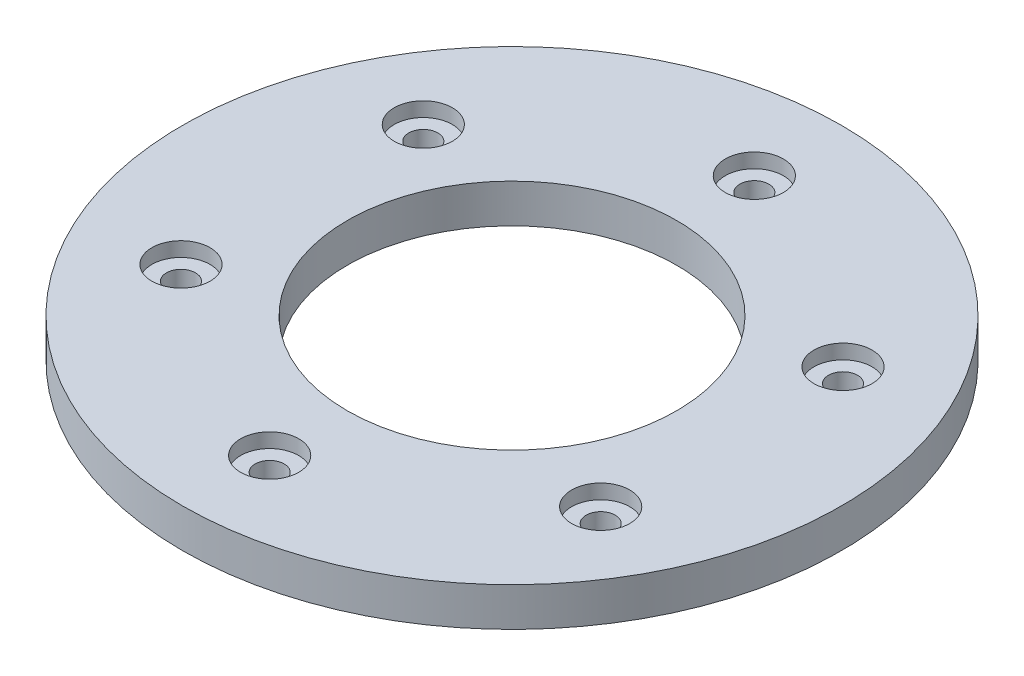
ISO-10303-21;
HEADER;
FILE_DESCRIPTION(('STEP AP214'),'2;1');
FILE_NAME('part.step','',(''),(''),'','','');
FILE_SCHEMA(('AUTOMOTIVE_DESIGN { 1 0 10303 214 1 1 1 1 }'));
ENDSEC;
DATA;
#1=APPLICATION_CONTEXT('core data for automotive mechanical design processes');
#2=APPLICATION_PROTOCOL_DEFINITION('international standard','automotive_design',2000,#1);
#3=PRODUCT_CONTEXT('',#1,'mechanical');
#4=PRODUCT('Part','Part','',(#3));
#5=PRODUCT_RELATED_PRODUCT_CATEGORY('part','',(#4));
#6=PRODUCT_DEFINITION_FORMATION('','',#4);
#7=PRODUCT_DEFINITION_CONTEXT('part definition',#1,'design');
#8=PRODUCT_DEFINITION('design','',#6,#7);
#9=PRODUCT_DEFINITION_SHAPE('','',#8);
#10=(LENGTH_UNIT() NAMED_UNIT(*) SI_UNIT(.MILLI.,.METRE.));
#11=(NAMED_UNIT(*) PLANE_ANGLE_UNIT() SI_UNIT($,.RADIAN.));
#12=(NAMED_UNIT(*) SI_UNIT($,.STERADIAN.) SOLID_ANGLE_UNIT());
#13=UNCERTAINTY_MEASURE_WITH_UNIT(LENGTH_MEASURE(1.E-05),#10,'distance_accuracy_value','');
#14=(GEOMETRIC_REPRESENTATION_CONTEXT(3) GLOBAL_UNCERTAINTY_ASSIGNED_CONTEXT((#13)) GLOBAL_UNIT_ASSIGNED_CONTEXT((#10,
#11,#12)) REPRESENTATION_CONTEXT('',''));
#15=CARTESIAN_POINT('',(0.,0.,0.));
#16=DIRECTION('',(0.,0.,1.));
#17=DIRECTION('',(1.,0.,0.));
#18=AXIS2_PLACEMENT_3D('',#15,#16,#17);
#19=CARTESIAN_POINT('',(0.,4.,0.));
#20=DIRECTION('',(0.,-1.,0.));
#21=DIRECTION('',(0.,0.,-1.));
#22=AXIS2_PLACEMENT_3D('',#19,#20,#21);
#23=CYLINDRICAL_SURFACE('',#22,34.);
#24=CARTESIAN_POINT('',(0.,4.,0.));
#25=DIRECTION('',(0.,1.,0.));
#26=DIRECTION('',(0.,0.,1.));
#27=AXIS2_PLACEMENT_3D('',#24,#25,#26);
#28=CIRCLE('',#27,34.);
#29=CARTESIAN_POINT('',(0.,4.,34.));
#30=VERTEX_POINT('',#29);
#31=EDGE_CURVE('E10',#30,#30,#28,.T.);
#32=ORIENTED_EDGE('',*,*,#31,.F.);
#33=EDGE_LOOP('',(#32));
#34=FACE_BOUND('',#33,.T.);
#35=CARTESIAN_POINT('',(0.,0.,0.));
#36=DIRECTION('',(0.,1.,0.));
#37=DIRECTION('',(0.,0.,1.));
#38=AXIS2_PLACEMENT_3D('',#35,#36,#37);
#39=CIRCLE('',#38,34.);
#40=CARTESIAN_POINT('',(0.,0.,34.));
#41=VERTEX_POINT('',#40);
#42=EDGE_CURVE('E41',#41,#41,#39,.T.);
#43=ORIENTED_EDGE('',*,*,#42,.T.);
#44=EDGE_LOOP('',(#43));
#45=FACE_BOUND('',#44,.T.);
#46=ADVANCED_FACE('F34',(#34,#45),#23,.T.);
#47=CARTESIAN_POINT('',(0.,4.,0.));
#48=DIRECTION('',(0.,1.,0.));
#49=DIRECTION('',(0.,0.,1.));
#50=AXIS2_PLACEMENT_3D('',#47,#48,#49);
#51=PLANE('',#50);
#52=CARTESIAN_POINT('',(0.,4.,0.));
#53=DIRECTION('',(0.,1.,0.));
#54=DIRECTION('',(0.,0.,1.));
#55=AXIS2_PLACEMENT_3D('',#52,#53,#54);
#56=CIRCLE('',#55,17.);
#57=CARTESIAN_POINT('',(0.,4.,17.));
#58=VERTEX_POINT('',#57);
#59=EDGE_CURVE('E238',#58,#58,#56,.T.);
#60=ORIENTED_EDGE('',*,*,#59,.F.);
#61=EDGE_LOOP('',(#60));
#62=FACE_BOUND('',#61,.T.);
#63=CARTESIAN_POINT('',(0.,4.,-25.));
#64=DIRECTION('',(0.,1.,0.));
#65=DIRECTION('',(0.,0.,1.));
#66=AXIS2_PLACEMENT_3D('',#63,#64,#65);
#67=CIRCLE('',#66,3.00000000000001);
#68=CARTESIAN_POINT('',(0.,4.,-22.));
#69=VERTEX_POINT('',#68);
#70=EDGE_CURVE('E88',#69,#69,#67,.T.);
#71=ORIENTED_EDGE('',*,*,#70,.F.);
#72=EDGE_LOOP('',(#71));
#73=FACE_BOUND('',#72,.T.);
#74=CARTESIAN_POINT('',(21.6506350946117,4.,-12.5000000000012));
#75=DIRECTION('',(0.,1.,0.));
#76=DIRECTION('',(0.,0.,1.));
#77=AXIS2_PLACEMENT_3D('',#74,#75,#76);
#78=CIRCLE('',#77,3.00000000000001);
#79=CARTESIAN_POINT('',(21.6506350946117,4.,-9.50000000000122));
#80=VERTEX_POINT('',#79);
#81=EDGE_CURVE('E75',#80,#80,#78,.T.);
#82=ORIENTED_EDGE('',*,*,#81,.F.);
#83=EDGE_LOOP('',(#82));
#84=FACE_BOUND('',#83,.T.);
#85=CARTESIAN_POINT('',(21.6506350946131,4.,12.4999999999988));
#86=DIRECTION('',(0.,1.,0.));
#87=DIRECTION('',(0.,0.,1.));
#88=AXIS2_PLACEMENT_3D('',#85,#86,#87);
#89=CIRCLE('',#88,3.00000000000001);
#90=CARTESIAN_POINT('',(21.6506350946131,4.,15.4999999999988));
#91=VERTEX_POINT('',#90);
#92=EDGE_CURVE('E71',#91,#91,#89,.T.);
#93=ORIENTED_EDGE('',*,*,#92,.F.);
#94=EDGE_LOOP('',(#93));
#95=FACE_BOUND('',#94,.T.);
#96=CARTESIAN_POINT('',(2.83604770904466E-12,4.,25.));
#97=DIRECTION('',(0.,1.,0.));
#98=DIRECTION('',(0.,0.,1.));
#99=AXIS2_PLACEMENT_3D('',#96,#97,#98);
#100=CIRCLE('',#99,3.00000000000001);
#101=CARTESIAN_POINT('',(2.83604770904466E-12,4.,28.));
#102=VERTEX_POINT('',#101);
#103=EDGE_CURVE('E67',#102,#102,#100,.T.);
#104=ORIENTED_EDGE('',*,*,#103,.F.);
#105=EDGE_LOOP('',(#104));
#106=FACE_BOUND('',#105,.T.);
#107=CARTESIAN_POINT('',(-21.6506350946088,4.,12.5000000000012));
#108=DIRECTION('',(0.,1.,0.));
#109=DIRECTION('',(0.,0.,1.));
#110=AXIS2_PLACEMENT_3D('',#107,#108,#109);
#111=CIRCLE('',#110,3.00000000000001);
#112=CARTESIAN_POINT('',(-21.6506350946088,4.,15.5000000000013));
#113=VERTEX_POINT('',#112);
#114=EDGE_CURVE('E62',#113,#113,#111,.T.);
#115=ORIENTED_EDGE('',*,*,#114,.F.);
#116=EDGE_LOOP('',(#115));
#117=FACE_BOUND('',#116,.T.);
#118=CARTESIAN_POINT('',(-21.6506350946103,4.,-12.4999999999988));
#119=DIRECTION('',(0.,1.,0.));
#120=DIRECTION('',(0.,0.,1.));
#121=AXIS2_PLACEMENT_3D('',#118,#119,#120);
#122=CIRCLE('',#121,3.00000000000001);
#123=CARTESIAN_POINT('',(-21.6506350946103,4.,-9.49999999999874));
#124=VERTEX_POINT('',#123);
#125=EDGE_CURVE('E57',#124,#124,#122,.T.);
#126=ORIENTED_EDGE('',*,*,#125,.F.);
#127=EDGE_LOOP('',(#126));
#128=FACE_BOUND('',#127,.T.);
#129=ORIENTED_EDGE('',*,*,#31,.T.);
#130=EDGE_LOOP('',(#129));
#131=FACE_BOUND('',#130,.T.);
#132=ADVANCED_FACE('F142',(#62,#73,#84,#95,#106,#117,#128,#131),#51,.T.);
#133=CARTESIAN_POINT('',(0.,0.,0.));
#134=DIRECTION('',(0.,1.,0.));
#135=DIRECTION('',(0.,0.,1.));
#136=AXIS2_PLACEMENT_3D('',#133,#134,#135);
#137=PLANE('',#136);
#138=CARTESIAN_POINT('',(0.,0.,0.));
#139=DIRECTION('',(0.,1.,0.));
#140=DIRECTION('',(0.,0.,1.));
#141=AXIS2_PLACEMENT_3D('',#138,#139,#140);
#142=CIRCLE('',#141,17.);
#143=CARTESIAN_POINT('',(0.,0.,17.));
#144=VERTEX_POINT('',#143);
#145=EDGE_CURVE('E37',#144,#144,#142,.T.);
#146=ORIENTED_EDGE('',*,*,#145,.T.);
#147=EDGE_LOOP('',(#146));
#148=FACE_BOUND('',#147,.T.);
#149=CARTESIAN_POINT('',(0.,0.,-25.));
#150=DIRECTION('',(0.,1.,0.));
#151=DIRECTION('',(0.,0.,1.));
#152=AXIS2_PLACEMENT_3D('',#149,#150,#151);
#153=CIRCLE('',#152,1.50000000000001);
#154=CARTESIAN_POINT('',(0.,0.,-23.5));
#155=VERTEX_POINT('',#154);
#156=EDGE_CURVE('E73',#155,#155,#153,.T.);
#157=ORIENTED_EDGE('',*,*,#156,.T.);
#158=EDGE_LOOP('',(#157));
#159=FACE_BOUND('',#158,.T.);
#160=CARTESIAN_POINT('',(21.6506350946117,0.,-12.5000000000012));
#161=DIRECTION('',(0.,1.,0.));
#162=DIRECTION('',(0.,0.,1.));
#163=AXIS2_PLACEMENT_3D('',#160,#161,#162);
#164=CIRCLE('',#163,1.50000000000001);
#165=CARTESIAN_POINT('',(21.6506350946117,0.,-11.0000000000012));
#166=VERTEX_POINT('',#165);
#167=EDGE_CURVE('E69',#166,#166,#164,.T.);
#168=ORIENTED_EDGE('',*,*,#167,.T.);
#169=EDGE_LOOP('',(#168));
#170=FACE_BOUND('',#169,.T.);
#171=CARTESIAN_POINT('',(21.6506350946131,0.,12.4999999999988));
#172=DIRECTION('',(0.,1.,0.));
#173=DIRECTION('',(0.,0.,1.));
#174=AXIS2_PLACEMENT_3D('',#171,#172,#173);
#175=CIRCLE('',#174,1.50000000000001);
#176=CARTESIAN_POINT('',(21.6506350946131,0.,13.9999999999988));
#177=VERTEX_POINT('',#176);
#178=EDGE_CURVE('E64',#177,#177,#175,.T.);
#179=ORIENTED_EDGE('',*,*,#178,.T.);
#180=EDGE_LOOP('',(#179));
#181=FACE_BOUND('',#180,.T.);
#182=CARTESIAN_POINT('',(2.83604770904466E-12,0.,25.));
#183=DIRECTION('',(0.,1.,0.));
#184=DIRECTION('',(0.,0.,1.));
#185=AXIS2_PLACEMENT_3D('',#182,#183,#184);
#186=CIRCLE('',#185,1.50000000000001);
#187=CARTESIAN_POINT('',(2.83604770904466E-12,0.,26.5));
#188=VERTEX_POINT('',#187);
#189=EDGE_CURVE('E59',#188,#188,#186,.T.);
#190=ORIENTED_EDGE('',*,*,#189,.T.);
#191=EDGE_LOOP('',(#190));
#192=FACE_BOUND('',#191,.T.);
#193=CARTESIAN_POINT('',(-21.6506350946088,0.,12.5000000000012));
#194=DIRECTION('',(0.,1.,0.));
#195=DIRECTION('',(0.,0.,1.));
#196=AXIS2_PLACEMENT_3D('',#193,#194,#195);
#197=CIRCLE('',#196,1.50000000000001);
#198=CARTESIAN_POINT('',(-21.6506350946088,0.,14.0000000000012));
#199=VERTEX_POINT('',#198);
#200=EDGE_CURVE('E54',#199,#199,#197,.T.);
#201=ORIENTED_EDGE('',*,*,#200,.T.);
#202=EDGE_LOOP('',(#201));
#203=FACE_BOUND('',#202,.T.);
#204=CARTESIAN_POINT('',(-21.6506350946103,0.,-12.4999999999988));
#205=DIRECTION('',(0.,1.,0.));
#206=DIRECTION('',(0.,0.,1.));
#207=AXIS2_PLACEMENT_3D('',#204,#205,#206);
#208=CIRCLE('',#207,1.50000000000001);
#209=CARTESIAN_POINT('',(-21.6506350946103,0.,-10.9999999999987));
#210=VERTEX_POINT('',#209);
#211=EDGE_CURVE('E46',#210,#210,#208,.T.);
#212=ORIENTED_EDGE('',*,*,#211,.T.);
#213=EDGE_LOOP('',(#212));
#214=FACE_BOUND('',#213,.T.);
#215=ORIENTED_EDGE('',*,*,#42,.F.);
#216=EDGE_LOOP('',(#215));
#217=FACE_BOUND('',#216,.T.);
#218=ADVANCED_FACE('F139',(#148,#159,#170,#181,#192,#203,#214,#217),#137,.F.);
#219=CARTESIAN_POINT('',(-21.6506350946103,4.,-12.4999999999988));
#220=DIRECTION('',(0.,1.,0.));
#221=DIRECTION('',(0.,0.,1.));
#222=AXIS2_PLACEMENT_3D('',#219,#220,#221);
#223=CYLINDRICAL_SURFACE('',#222,1.50000000000001);
#224=CARTESIAN_POINT('',(-21.6506350946103,2.5,-12.4999999999988));
#225=DIRECTION('',(0.,1.,0.));
#226=DIRECTION('',(0.,0.,1.));
#227=AXIS2_PLACEMENT_3D('',#224,#225,#226);
#228=CIRCLE('',#227,1.50000000000001);
#229=CARTESIAN_POINT('',(-21.6506350946103,2.5,-10.9999999999987));
#230=VERTEX_POINT('',#229);
#231=EDGE_CURVE('E49',#230,#230,#228,.T.);
#232=ORIENTED_EDGE('',*,*,#231,.T.);
#233=EDGE_LOOP('',(#232));
#234=FACE_BOUND('',#233,.T.);
#235=ORIENTED_EDGE('',*,*,#211,.F.);
#236=EDGE_LOOP('',(#235));
#237=FACE_BOUND('',#236,.T.);
#238=ADVANCED_FACE('F125',(#234,#237),#223,.F.);
#239=CARTESIAN_POINT('',(-20.1506350946103,2.5,-12.4999999999988));
#240=DIRECTION('',(0.,-1.,0.));
#241=DIRECTION('',(0.,0.,-1.));
#242=AXIS2_PLACEMENT_3D('',#239,#240,#241);
#243=PLANE('',#242);
#244=ORIENTED_EDGE('',*,*,#231,.F.);
#245=EDGE_LOOP('',(#244));
#246=FACE_BOUND('',#245,.T.);
#247=CARTESIAN_POINT('',(-21.6506350946103,2.5,-12.4999999999988));
#248=DIRECTION('',(0.,1.,0.));
#249=DIRECTION('',(0.,0.,1.));
#250=AXIS2_PLACEMENT_3D('',#247,#248,#249);
#251=CIRCLE('',#250,3.00000000000001);
#252=CARTESIAN_POINT('',(-21.6506350946103,2.5,-9.49999999999874));
#253=VERTEX_POINT('',#252);
#254=EDGE_CURVE('E118',#253,#253,#251,.T.);
#255=ORIENTED_EDGE('',*,*,#254,.T.);
#256=EDGE_LOOP('',(#255));
#257=FACE_BOUND('',#256,.T.);
#258=ADVANCED_FACE('F128',(#246,#257),#243,.F.);
#259=CARTESIAN_POINT('',(-21.6506350946103,4.,-12.4999999999988));
#260=DIRECTION('',(0.,1.,0.));
#261=DIRECTION('',(0.,0.,1.));
#262=AXIS2_PLACEMENT_3D('',#259,#260,#261);
#263=CYLINDRICAL_SURFACE('',#262,3.00000000000001);
#264=ORIENTED_EDGE('',*,*,#254,.F.);
#265=EDGE_LOOP('',(#264));
#266=FACE_BOUND('',#265,.T.);
#267=ORIENTED_EDGE('',*,*,#125,.T.);
#268=EDGE_LOOP('',(#267));
#269=FACE_BOUND('',#268,.T.);
#270=ADVANCED_FACE('F130',(#266,#269),#263,.F.);
#271=CARTESIAN_POINT('',(-21.6506350946088,4.,12.5000000000012));
#272=DIRECTION('',(0.,1.,0.));
#273=DIRECTION('',(0.,0.,1.));
#274=AXIS2_PLACEMENT_3D('',#271,#272,#273);
#275=CYLINDRICAL_SURFACE('',#274,1.50000000000001);
#276=CARTESIAN_POINT('',(-21.6506350946088,2.5,12.5000000000012));
#277=DIRECTION('',(0.,1.,0.));
#278=DIRECTION('',(0.,0.,1.));
#279=AXIS2_PLACEMENT_3D('',#276,#277,#278);
#280=CIRCLE('',#279,1.50000000000001);
#281=CARTESIAN_POINT('',(-21.6506350946088,2.5,14.0000000000012));
#282=VERTEX_POINT('',#281);
#283=EDGE_CURVE('E58',#282,#282,#280,.T.);
#284=ORIENTED_EDGE('',*,*,#283,.T.);
#285=EDGE_LOOP('',(#284));
#286=FACE_BOUND('',#285,.T.);
#287=ORIENTED_EDGE('',*,*,#200,.F.);
#288=EDGE_LOOP('',(#287));
#289=FACE_BOUND('',#288,.T.);
#290=ADVANCED_FACE('F136',(#286,#289),#275,.F.);
#291=CARTESIAN_POINT('',(-20.1506350946088,2.5,12.5000000000012));
#292=DIRECTION('',(0.,-1.,0.));
#293=DIRECTION('',(0.,0.,-1.));
#294=AXIS2_PLACEMENT_3D('',#291,#292,#293);
#295=PLANE('',#294);
#296=ORIENTED_EDGE('',*,*,#283,.F.);
#297=EDGE_LOOP('',(#296));
#298=FACE_BOUND('',#297,.T.);
#299=CARTESIAN_POINT('',(-21.6506350946088,2.5,12.5000000000012));
#300=DIRECTION('',(0.,1.,0.));
#301=DIRECTION('',(0.,0.,1.));
#302=AXIS2_PLACEMENT_3D('',#299,#300,#301);
#303=CIRCLE('',#302,3.00000000000001);
#304=CARTESIAN_POINT('',(-21.6506350946088,2.5,15.5000000000013));
#305=VERTEX_POINT('',#304);
#306=EDGE_CURVE('E112',#305,#305,#303,.T.);
#307=ORIENTED_EDGE('',*,*,#306,.T.);
#308=EDGE_LOOP('',(#307));
#309=FACE_BOUND('',#308,.T.);
#310=ADVANCED_FACE('F170',(#298,#309),#295,.F.);
#311=CARTESIAN_POINT('',(-21.6506350946088,4.,12.5000000000012));
#312=DIRECTION('',(0.,1.,0.));
#313=DIRECTION('',(0.,0.,1.));
#314=AXIS2_PLACEMENT_3D('',#311,#312,#313);
#315=CYLINDRICAL_SURFACE('',#314,3.00000000000001);
#316=ORIENTED_EDGE('',*,*,#306,.F.);
#317=EDGE_LOOP('',(#316));
#318=FACE_BOUND('',#317,.T.);
#319=ORIENTED_EDGE('',*,*,#114,.T.);
#320=EDGE_LOOP('',(#319));
#321=FACE_BOUND('',#320,.T.);
#322=ADVANCED_FACE('F176',(#318,#321),#315,.F.);
#323=CARTESIAN_POINT('',(2.83604770904466E-12,4.,25.));
#324=DIRECTION('',(0.,1.,0.));
#325=DIRECTION('',(0.,0.,1.));
#326=AXIS2_PLACEMENT_3D('',#323,#324,#325);
#327=CYLINDRICAL_SURFACE('',#326,1.50000000000001);
#328=CARTESIAN_POINT('',(2.83604770904466E-12,2.5,25.));
#329=DIRECTION('',(0.,1.,0.));
#330=DIRECTION('',(0.,0.,1.));
#331=AXIS2_PLACEMENT_3D('',#328,#329,#330);
#332=CIRCLE('',#331,1.50000000000001);
#333=CARTESIAN_POINT('',(2.83604770904466E-12,2.5,26.5));
#334=VERTEX_POINT('',#333);
#335=EDGE_CURVE('E63',#334,#334,#332,.T.);
#336=ORIENTED_EDGE('',*,*,#335,.T.);
#337=EDGE_LOOP('',(#336));
#338=FACE_BOUND('',#337,.T.);
#339=ORIENTED_EDGE('',*,*,#189,.F.);
#340=EDGE_LOOP('',(#339));
#341=FACE_BOUND('',#340,.T.);
#342=ADVANCED_FACE('F182',(#338,#341),#327,.F.);
#343=CARTESIAN_POINT('',(1.50000000000285,2.5,25.));
#344=DIRECTION('',(0.,-1.,0.));
#345=DIRECTION('',(0.,0.,-1.));
#346=AXIS2_PLACEMENT_3D('',#343,#344,#345);
#347=PLANE('',#346);
#348=ORIENTED_EDGE('',*,*,#335,.F.);
#349=EDGE_LOOP('',(#348));
#350=FACE_BOUND('',#349,.T.);
#351=CARTESIAN_POINT('',(2.83604770904466E-12,2.5,25.));
#352=DIRECTION('',(0.,1.,0.));
#353=DIRECTION('',(0.,0.,1.));
#354=AXIS2_PLACEMENT_3D('',#351,#352,#353);
#355=CIRCLE('',#354,3.00000000000001);
#356=CARTESIAN_POINT('',(2.83604770904466E-12,2.5,28.));
#357=VERTEX_POINT('',#356);
#358=EDGE_CURVE('E105',#357,#357,#355,.T.);
#359=ORIENTED_EDGE('',*,*,#358,.T.);
#360=EDGE_LOOP('',(#359));
#361=FACE_BOUND('',#360,.T.);
#362=ADVANCED_FACE('F186',(#350,#361),#347,.F.);
#363=CARTESIAN_POINT('',(2.83604770904466E-12,4.,25.));
#364=DIRECTION('',(0.,1.,0.));
#365=DIRECTION('',(0.,0.,1.));
#366=AXIS2_PLACEMENT_3D('',#363,#364,#365);
#367=CYLINDRICAL_SURFACE('',#366,3.00000000000001);
#368=ORIENTED_EDGE('',*,*,#358,.F.);
#369=EDGE_LOOP('',(#368));
#370=FACE_BOUND('',#369,.T.);
#371=ORIENTED_EDGE('',*,*,#103,.T.);
#372=EDGE_LOOP('',(#371));
#373=FACE_BOUND('',#372,.T.);
#374=ADVANCED_FACE('F190',(#370,#373),#367,.F.);
#375=CARTESIAN_POINT('',(21.6506350946131,4.,12.4999999999988));
#376=DIRECTION('',(0.,1.,0.));
#377=DIRECTION('',(0.,0.,1.));
#378=AXIS2_PLACEMENT_3D('',#375,#376,#377);
#379=CYLINDRICAL_SURFACE('',#378,1.50000000000001);
#380=CARTESIAN_POINT('',(21.6506350946131,2.5,12.4999999999988));
#381=DIRECTION('',(0.,1.,0.));
#382=DIRECTION('',(0.,0.,1.));
#383=AXIS2_PLACEMENT_3D('',#380,#381,#382);
#384=CIRCLE('',#383,1.50000000000002);
#385=CARTESIAN_POINT('',(21.6506350946131,2.5,13.9999999999988));
#386=VERTEX_POINT('',#385);
#387=EDGE_CURVE('E68',#386,#386,#384,.T.);
#388=ORIENTED_EDGE('',*,*,#387,.T.);
#389=EDGE_LOOP('',(#388));
#390=FACE_BOUND('',#389,.T.);
#391=ORIENTED_EDGE('',*,*,#178,.F.);
#392=EDGE_LOOP('',(#391));
#393=FACE_BOUND('',#392,.T.);
#394=ADVANCED_FACE('F194',(#390,#393),#379,.F.);
#395=CARTESIAN_POINT('',(23.1506350946131,2.5,12.4999999999988));
#396=DIRECTION('',(0.,-1.,0.));
#397=DIRECTION('',(0.,0.,-1.));
#398=AXIS2_PLACEMENT_3D('',#395,#396,#397);
#399=PLANE('',#398);
#400=ORIENTED_EDGE('',*,*,#387,.F.);
#401=EDGE_LOOP('',(#400));
#402=FACE_BOUND('',#401,.T.);
#403=CARTESIAN_POINT('',(21.6506350946131,2.5,12.4999999999988));
#404=DIRECTION('',(0.,1.,0.));
#405=DIRECTION('',(0.,0.,1.));
#406=AXIS2_PLACEMENT_3D('',#403,#404,#405);
#407=CIRCLE('',#406,3.00000000000001);
#408=CARTESIAN_POINT('',(21.6506350946131,2.5,15.4999999999988));
#409=VERTEX_POINT('',#408);
#410=EDGE_CURVE('E98',#409,#409,#407,.T.);
#411=ORIENTED_EDGE('',*,*,#410,.T.);
#412=EDGE_LOOP('',(#411));
#413=FACE_BOUND('',#412,.T.);
#414=ADVANCED_FACE('F198',(#402,#413),#399,.F.);
#415=CARTESIAN_POINT('',(21.6506350946131,4.,12.4999999999988));
#416=DIRECTION('',(0.,1.,0.));
#417=DIRECTION('',(0.,0.,1.));
#418=AXIS2_PLACEMENT_3D('',#415,#416,#417);
#419=CYLINDRICAL_SURFACE('',#418,3.00000000000001);
#420=ORIENTED_EDGE('',*,*,#410,.F.);
#421=EDGE_LOOP('',(#420));
#422=FACE_BOUND('',#421,.T.);
#423=ORIENTED_EDGE('',*,*,#92,.T.);
#424=EDGE_LOOP('',(#423));
#425=FACE_BOUND('',#424,.T.);
#426=ADVANCED_FACE('F202',(#422,#425),#419,.F.);
#427=CARTESIAN_POINT('',(21.6506350946117,4.,-12.5000000000012));
#428=DIRECTION('',(0.,1.,0.));
#429=DIRECTION('',(0.,0.,1.));
#430=AXIS2_PLACEMENT_3D('',#427,#428,#429);
#431=CYLINDRICAL_SURFACE('',#430,1.50000000000001);
#432=CARTESIAN_POINT('',(21.6506350946117,2.5,-12.5000000000012));
#433=DIRECTION('',(0.,1.,0.));
#434=DIRECTION('',(0.,0.,1.));
#435=AXIS2_PLACEMENT_3D('',#432,#433,#434);
#436=CIRCLE('',#435,1.50000000000002);
#437=CARTESIAN_POINT('',(21.6506350946117,2.5,-11.0000000000012));
#438=VERTEX_POINT('',#437);
#439=EDGE_CURVE('E72',#438,#438,#436,.T.);
#440=ORIENTED_EDGE('',*,*,#439,.T.);
#441=EDGE_LOOP('',(#440));
#442=FACE_BOUND('',#441,.T.);
#443=ORIENTED_EDGE('',*,*,#167,.F.);
#444=EDGE_LOOP('',(#443));
#445=FACE_BOUND('',#444,.T.);
#446=ADVANCED_FACE('F206',(#442,#445),#431,.F.);
#447=CARTESIAN_POINT('',(23.1506350946117,2.5,-12.5000000000012));
#448=DIRECTION('',(0.,-1.,0.));
#449=DIRECTION('',(0.,0.,-1.));
#450=AXIS2_PLACEMENT_3D('',#447,#448,#449);
#451=PLANE('',#450);
#452=ORIENTED_EDGE('',*,*,#439,.F.);
#453=EDGE_LOOP('',(#452));
#454=FACE_BOUND('',#453,.T.);
#455=CARTESIAN_POINT('',(21.6506350946117,2.5,-12.5000000000012));
#456=DIRECTION('',(0.,1.,0.));
#457=DIRECTION('',(0.,0.,1.));
#458=AXIS2_PLACEMENT_3D('',#455,#456,#457);
#459=CIRCLE('',#458,3.00000000000001);
#460=CARTESIAN_POINT('',(21.6506350946117,2.5,-9.50000000000122));
#461=VERTEX_POINT('',#460);
#462=EDGE_CURVE('E80',#461,#461,#459,.T.);
#463=ORIENTED_EDGE('',*,*,#462,.T.);
#464=EDGE_LOOP('',(#463));
#465=FACE_BOUND('',#464,.T.);
#466=ADVANCED_FACE('F210',(#454,#465),#451,.F.);
#467=CARTESIAN_POINT('',(21.6506350946117,4.,-12.5000000000012));
#468=DIRECTION('',(0.,1.,0.));
#469=DIRECTION('',(0.,0.,1.));
#470=AXIS2_PLACEMENT_3D('',#467,#468,#469);
#471=CYLINDRICAL_SURFACE('',#470,3.00000000000001);
#472=ORIENTED_EDGE('',*,*,#462,.F.);
#473=EDGE_LOOP('',(#472));
#474=FACE_BOUND('',#473,.T.);
#475=ORIENTED_EDGE('',*,*,#81,.T.);
#476=EDGE_LOOP('',(#475));
#477=FACE_BOUND('',#476,.T.);
#478=ADVANCED_FACE('F214',(#474,#477),#471,.F.);
#479=CARTESIAN_POINT('',(0.,4.,-25.));
#480=DIRECTION('',(0.,1.,0.));
#481=DIRECTION('',(0.,0.,1.));
#482=AXIS2_PLACEMENT_3D('',#479,#480,#481);
#483=CYLINDRICAL_SURFACE('',#482,1.50000000000001);
#484=CARTESIAN_POINT('',(0.,2.5,-25.));
#485=DIRECTION('',(0.,1.,0.));
#486=DIRECTION('',(0.,0.,1.));
#487=AXIS2_PLACEMENT_3D('',#484,#485,#486);
#488=CIRCLE('',#487,1.50000000000001);
#489=CARTESIAN_POINT('',(0.,2.5,-23.5));
#490=VERTEX_POINT('',#489);
#491=EDGE_CURVE('E76',#490,#490,#488,.T.);
#492=ORIENTED_EDGE('',*,*,#491,.T.);
#493=EDGE_LOOP('',(#492));
#494=FACE_BOUND('',#493,.T.);
#495=ORIENTED_EDGE('',*,*,#156,.F.);
#496=EDGE_LOOP('',(#495));
#497=FACE_BOUND('',#496,.T.);
#498=ADVANCED_FACE('F218',(#494,#497),#483,.F.);
#499=CARTESIAN_POINT('',(1.50000000000001,2.5,-25.));
#500=DIRECTION('',(0.,-1.,0.));
#501=DIRECTION('',(0.,0.,-1.));
#502=AXIS2_PLACEMENT_3D('',#499,#500,#501);
#503=PLANE('',#502);
#504=ORIENTED_EDGE('',*,*,#491,.F.);
#505=EDGE_LOOP('',(#504));
#506=FACE_BOUND('',#505,.T.);
#507=CARTESIAN_POINT('',(0.,2.5,-25.));
#508=DIRECTION('',(0.,1.,0.));
#509=DIRECTION('',(0.,0.,1.));
#510=AXIS2_PLACEMENT_3D('',#507,#508,#509);
#511=CIRCLE('',#510,3.00000000000001);
#512=CARTESIAN_POINT('',(0.,2.5,-22.));
#513=VERTEX_POINT('',#512);
#514=EDGE_CURVE('E83',#513,#513,#511,.T.);
#515=ORIENTED_EDGE('',*,*,#514,.T.);
#516=EDGE_LOOP('',(#515));
#517=FACE_BOUND('',#516,.T.);
#518=ADVANCED_FACE('F222',(#506,#517),#503,.F.);
#519=CARTESIAN_POINT('',(0.,4.,-25.));
#520=DIRECTION('',(0.,1.,0.));
#521=DIRECTION('',(0.,0.,1.));
#522=AXIS2_PLACEMENT_3D('',#519,#520,#521);
#523=CYLINDRICAL_SURFACE('',#522,3.00000000000001);
#524=ORIENTED_EDGE('',*,*,#514,.F.);
#525=EDGE_LOOP('',(#524));
#526=FACE_BOUND('',#525,.T.);
#527=ORIENTED_EDGE('',*,*,#70,.T.);
#528=EDGE_LOOP('',(#527));
#529=FACE_BOUND('',#528,.T.);
#530=ADVANCED_FACE('F225',(#526,#529),#523,.F.);
#531=CARTESIAN_POINT('',(0.,-1.,0.));
#532=DIRECTION('',(0.,1.,0.));
#533=DIRECTION('',(0.,0.,1.));
#534=AXIS2_PLACEMENT_3D('',#531,#532,#533);
#535=CYLINDRICAL_SURFACE('',#534,17.);
#536=ORIENTED_EDGE('',*,*,#59,.T.);
#537=EDGE_LOOP('',(#536));
#538=FACE_BOUND('',#537,.T.);
#539=ORIENTED_EDGE('',*,*,#145,.F.);
#540=EDGE_LOOP('',(#539));
#541=FACE_BOUND('',#540,.T.);
#542=ADVANCED_FACE('F229',(#538,#541),#535,.F.);
#543=CLOSED_SHELL('',(#46,#132,#218,#238,#258,#270,#290,#310,#322,#342,#362,#374,#394,#414,#426,
#446,#466,#478,#498,#518,#530,#542));
#544=MANIFOLD_SOLID_BREP('B2',#543);
#545=ADVANCED_BREP_SHAPE_REPRESENTATION('',(#18,#544),#14);
#546=SHAPE_DEFINITION_REPRESENTATION(#9,#545);
ENDSEC;
END-ISO-10303-21;
